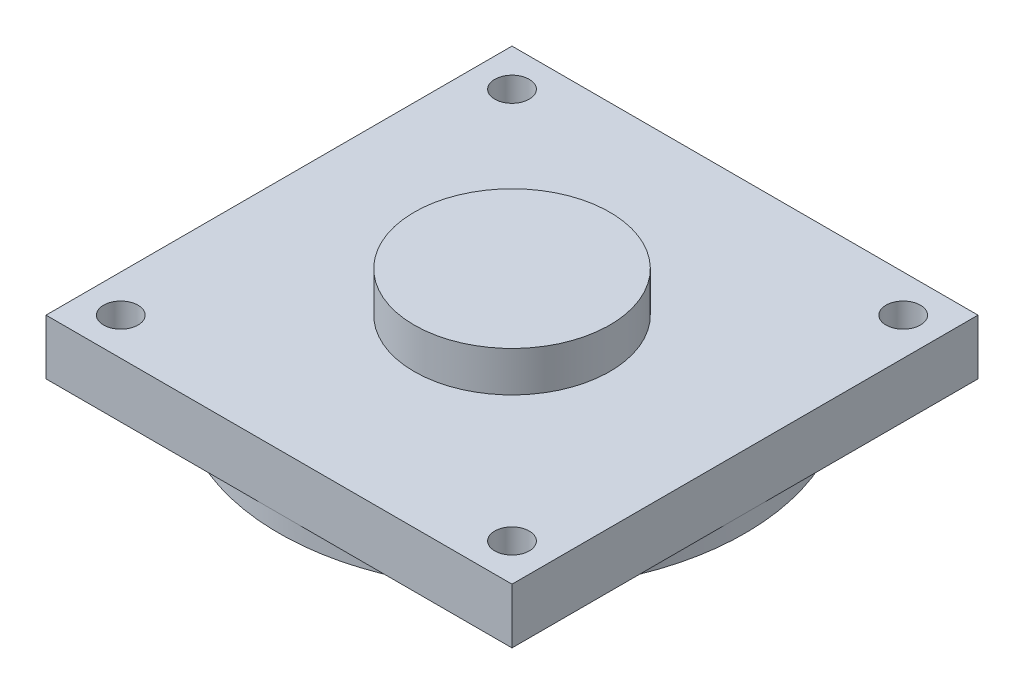
ISO-10303-21;
HEADER;
FILE_DESCRIPTION(('STEP AP214'),'2;1');
FILE_NAME('part.step','',(''),(''),'','','');
FILE_SCHEMA(('AUTOMOTIVE_DESIGN { 1 0 10303 214 1 1 1 1 }'));
ENDSEC;
DATA;
#1=APPLICATION_CONTEXT('core data for automotive mechanical design processes');
#2=APPLICATION_PROTOCOL_DEFINITION('international standard','automotive_design',2000,#1);
#3=PRODUCT_CONTEXT('',#1,'mechanical');
#4=PRODUCT('Part','Part','',(#3));
#5=PRODUCT_RELATED_PRODUCT_CATEGORY('part','',(#4));
#6=PRODUCT_DEFINITION_FORMATION('','',#4);
#7=PRODUCT_DEFINITION_CONTEXT('part definition',#1,'design');
#8=PRODUCT_DEFINITION('design','',#6,#7);
#9=PRODUCT_DEFINITION_SHAPE('','',#8);
#10=(LENGTH_UNIT() NAMED_UNIT(*) SI_UNIT(.MILLI.,.METRE.));
#11=(NAMED_UNIT(*) PLANE_ANGLE_UNIT() SI_UNIT($,.RADIAN.));
#12=(NAMED_UNIT(*) SI_UNIT($,.STERADIAN.) SOLID_ANGLE_UNIT());
#13=UNCERTAINTY_MEASURE_WITH_UNIT(LENGTH_MEASURE(1.E-05),#10,'distance_accuracy_value','');
#14=(GEOMETRIC_REPRESENTATION_CONTEXT(3) GLOBAL_UNCERTAINTY_ASSIGNED_CONTEXT((#13)) GLOBAL_UNIT_ASSIGNED_CONTEXT((#10,
#11,#12)) REPRESENTATION_CONTEXT('',''));
#15=CARTESIAN_POINT('',(0.,0.,0.));
#16=DIRECTION('',(0.,0.,1.));
#17=DIRECTION('',(1.,0.,0.));
#18=AXIS2_PLACEMENT_3D('',#15,#16,#17);
#19=CARTESIAN_POINT('',(0.,0.,0.));
#20=DIRECTION('',(0.,1.,0.));
#21=DIRECTION('',(0.,0.,1.));
#22=AXIS2_PLACEMENT_3D('',#19,#20,#21);
#23=PLANE('',#22);
#24=CARTESIAN_POINT('',(0.,0.,0.));
#25=DIRECTION('',(0.,-1.,0.));
#26=DIRECTION('',(0.,0.,-1.));
#27=AXIS2_PLACEMENT_3D('',#24,#25,#26);
#28=CIRCLE('',#27,20.25);
#29=CARTESIAN_POINT('',(0.,0.,-20.25));
#30=VERTEX_POINT('',#29);
#31=CARTESIAN_POINT('',(20.25,0.,0.));
#32=VERTEX_POINT('',#31);
#33=EDGE_CURVE('E46',#30,#32,#28,.T.);
#34=ORIENTED_EDGE('',*,*,#33,.F.);
#35=DIRECTION('',(-1.,0.,0.));
#36=VECTOR('',#35,1.);
#37=CARTESIAN_POINT('',(-20.25,0.,-20.25));
#38=LINE('',#37,#36);
#39=CARTESIAN_POINT('',(20.25,0.,-20.25));
#40=VERTEX_POINT('',#39);
#41=EDGE_CURVE('E93',#40,#30,#38,.T.);
#42=ORIENTED_EDGE('',*,*,#41,.F.);
#43=DIRECTION('',(0.,0.,-1.));
#44=VECTOR('',#43,1.);
#45=CARTESIAN_POINT('',(20.25,0.,-20.25));
#46=LINE('',#45,#44);
#47=EDGE_CURVE('E111',#32,#40,#46,.T.);
#48=ORIENTED_EDGE('',*,*,#47,.F.);
#49=EDGE_LOOP('',(#34,#42,#48));
#50=FACE_BOUND('',#49,.T.);
#51=CARTESIAN_POINT('',(17.,0.,-17.));
#52=DIRECTION('',(0.,1.,0.));
#53=DIRECTION('',(0.,0.,1.));
#54=AXIS2_PLACEMENT_3D('',#51,#52,#53);
#55=CIRCLE('',#54,1.5);
#56=CARTESIAN_POINT('',(17.,0.,-15.5));
#57=VERTEX_POINT('',#56);
#58=EDGE_CURVE('E140',#57,#57,#55,.T.);
#59=ORIENTED_EDGE('',*,*,#58,.T.);
#60=EDGE_LOOP('',(#59));
#61=FACE_BOUND('',#60,.T.);
#62=ADVANCED_FACE('F35',(#50,#61),#23,.F.);
#63=CARTESIAN_POINT('',(0.,0.,20.25));
#64=VERTEX_POINT('',#63);
#65=EDGE_CURVE('E11',#32,#64,#28,.T.);
#66=ORIENTED_EDGE('',*,*,#65,.F.);
#67=CARTESIAN_POINT('',(20.25,0.,20.25));
#68=VERTEX_POINT('',#67);
#69=EDGE_CURVE('E108',#68,#32,#46,.T.);
#70=ORIENTED_EDGE('',*,*,#69,.F.);
#71=DIRECTION('',(1.,0.,0.));
#72=VECTOR('',#71,1.);
#73=CARTESIAN_POINT('',(-20.25,0.,20.25));
#74=LINE('',#73,#72);
#75=EDGE_CURVE('E161',#64,#68,#74,.T.);
#76=ORIENTED_EDGE('',*,*,#75,.F.);
#77=EDGE_LOOP('',(#66,#70,#76));
#78=FACE_BOUND('',#77,.T.);
#79=CARTESIAN_POINT('',(17.,0.,17.));
#80=DIRECTION('',(0.,1.,0.));
#81=DIRECTION('',(0.,0.,1.));
#82=AXIS2_PLACEMENT_3D('',#79,#80,#81);
#83=CIRCLE('',#82,1.5);
#84=CARTESIAN_POINT('',(17.,0.,18.5));
#85=VERTEX_POINT('',#84);
#86=EDGE_CURVE('E134',#85,#85,#83,.T.);
#87=ORIENTED_EDGE('',*,*,#86,.T.);
#88=EDGE_LOOP('',(#87));
#89=FACE_BOUND('',#88,.T.);
#90=ADVANCED_FACE('F181',(#78,#89),#23,.F.);
#91=CARTESIAN_POINT('',(-20.25,0.,0.));
#92=VERTEX_POINT('',#91);
#93=EDGE_CURVE('E44',#64,#92,#28,.T.);
#94=ORIENTED_EDGE('',*,*,#93,.F.);
#95=CARTESIAN_POINT('',(-20.25,0.,20.25));
#96=VERTEX_POINT('',#95);
#97=EDGE_CURVE('E152',#96,#64,#74,.T.);
#98=ORIENTED_EDGE('',*,*,#97,.F.);
#99=DIRECTION('',(0.,0.,1.));
#100=VECTOR('',#99,1.);
#101=CARTESIAN_POINT('',(-20.25,0.,-20.25));
#102=LINE('',#101,#100);
#103=EDGE_CURVE('E102',#92,#96,#102,.T.);
#104=ORIENTED_EDGE('',*,*,#103,.F.);
#105=EDGE_LOOP('',(#94,#98,#104));
#106=FACE_BOUND('',#105,.T.);
#107=CARTESIAN_POINT('',(-17.,0.,17.));
#108=DIRECTION('',(0.,1.,0.));
#109=DIRECTION('',(0.,0.,1.));
#110=AXIS2_PLACEMENT_3D('',#107,#108,#109);
#111=CIRCLE('',#110,1.5);
#112=CARTESIAN_POINT('',(-17.,0.,18.5));
#113=VERTEX_POINT('',#112);
#114=EDGE_CURVE('E128',#113,#113,#111,.T.);
#115=ORIENTED_EDGE('',*,*,#114,.T.);
#116=EDGE_LOOP('',(#115));
#117=FACE_BOUND('',#116,.T.);
#118=ADVANCED_FACE('F185',(#106,#117),#23,.F.);
#119=CARTESIAN_POINT('',(20.25,4.8,-20.25));
#120=DIRECTION('',(-1.,0.,0.));
#121=DIRECTION('',(0.,0.,1.));
#122=AXIS2_PLACEMENT_3D('',#119,#120,#121);
#123=PLANE('',#122);
#124=ORIENTED_EDGE('',*,*,#69,.T.);
#125=ORIENTED_EDGE('',*,*,#47,.T.);
#126=DIRECTION('',(0.,-1.,0.));
#127=VECTOR('',#126,1.);
#128=CARTESIAN_POINT('',(20.25,4.8,-20.25));
#129=LINE('',#128,#127);
#130=CARTESIAN_POINT('',(20.25,4.8,-20.25));
#131=VERTEX_POINT('',#130);
#132=EDGE_CURVE('E39',#131,#40,#129,.T.);
#133=ORIENTED_EDGE('',*,*,#132,.F.);
#134=DIRECTION('',(0.,0.,-1.));
#135=VECTOR('',#134,1.);
#136=CARTESIAN_POINT('',(20.25,4.8,-20.25));
#137=LINE('',#136,#135);
#138=CARTESIAN_POINT('',(20.25,4.8,20.25));
#139=VERTEX_POINT('',#138);
#140=EDGE_CURVE('E148',#139,#131,#137,.T.);
#141=ORIENTED_EDGE('',*,*,#140,.F.);
#142=DIRECTION('',(0.,-1.,0.));
#143=VECTOR('',#142,1.);
#144=CARTESIAN_POINT('',(20.25,4.8,20.25));
#145=LINE('',#144,#143);
#146=EDGE_CURVE('E158',#139,#68,#145,.T.);
#147=ORIENTED_EDGE('',*,*,#146,.T.);
#148=EDGE_LOOP('',(#124,#125,#133,#141,#147));
#149=FACE_BOUND('',#148,.T.);
#150=ADVANCED_FACE('F37',(#149),#123,.F.);
#151=CARTESIAN_POINT('',(-20.25,4.8,-20.25));
#152=DIRECTION('',(0.,0.,1.));
#153=DIRECTION('',(1.,0.,0.));
#154=AXIS2_PLACEMENT_3D('',#151,#152,#153);
#155=PLANE('',#154);
#156=ORIENTED_EDGE('',*,*,#41,.T.);
#157=CARTESIAN_POINT('',(-20.25,0.,-20.25));
#158=VERTEX_POINT('',#157);
#159=EDGE_CURVE('E96',#30,#158,#38,.T.);
#160=ORIENTED_EDGE('',*,*,#159,.T.);
#161=DIRECTION('',(0.,-1.,0.));
#162=VECTOR('',#161,1.);
#163=CARTESIAN_POINT('',(-20.25,4.8,-20.25));
#164=LINE('',#163,#162);
#165=CARTESIAN_POINT('',(-20.25,4.8,-20.25));
#166=VERTEX_POINT('',#165);
#167=EDGE_CURVE('E168',#166,#158,#164,.T.);
#168=ORIENTED_EDGE('',*,*,#167,.F.);
#169=DIRECTION('',(-1.,0.,0.));
#170=VECTOR('',#169,1.);
#171=CARTESIAN_POINT('',(-20.25,4.8,-20.25));
#172=LINE('',#171,#170);
#173=EDGE_CURVE('E151',#131,#166,#172,.T.);
#174=ORIENTED_EDGE('',*,*,#173,.F.);
#175=ORIENTED_EDGE('',*,*,#132,.T.);
#176=EDGE_LOOP('',(#156,#160,#168,#174,#175));
#177=FACE_BOUND('',#176,.T.);
#178=ADVANCED_FACE('F94',(#177),#155,.F.);
#179=CARTESIAN_POINT('',(-20.25,4.8,-20.25));
#180=DIRECTION('',(1.,0.,0.));
#181=DIRECTION('',(0.,0.,-1.));
#182=AXIS2_PLACEMENT_3D('',#179,#180,#181);
#183=PLANE('',#182);
#184=EDGE_CURVE('E107',#158,#92,#102,.T.);
#185=ORIENTED_EDGE('',*,*,#184,.T.);
#186=ORIENTED_EDGE('',*,*,#103,.T.);
#187=DIRECTION('',(0.,-1.,0.));
#188=VECTOR('',#187,1.);
#189=CARTESIAN_POINT('',(-20.25,4.8,20.25));
#190=LINE('',#189,#188);
#191=CARTESIAN_POINT('',(-20.25,4.8,20.25));
#192=VERTEX_POINT('',#191);
#193=EDGE_CURVE('E166',#192,#96,#190,.T.);
#194=ORIENTED_EDGE('',*,*,#193,.F.);
#195=DIRECTION('',(0.,0.,1.));
#196=VECTOR('',#195,1.);
#197=CARTESIAN_POINT('',(-20.25,4.8,-20.25));
#198=LINE('',#197,#196);
#199=EDGE_CURVE('E154',#166,#192,#198,.T.);
#200=ORIENTED_EDGE('',*,*,#199,.F.);
#201=ORIENTED_EDGE('',*,*,#167,.T.);
#202=EDGE_LOOP('',(#185,#186,#194,#200,#201));
#203=FACE_BOUND('',#202,.T.);
#204=ADVANCED_FACE('F171',(#203),#183,.F.);
#205=CARTESIAN_POINT('',(-20.25,4.8,20.25));
#206=DIRECTION('',(0.,0.,-1.));
#207=DIRECTION('',(-1.,0.,0.));
#208=AXIS2_PLACEMENT_3D('',#205,#206,#207);
#209=PLANE('',#208);
#210=ORIENTED_EDGE('',*,*,#97,.T.);
#211=ORIENTED_EDGE('',*,*,#75,.T.);
#212=ORIENTED_EDGE('',*,*,#146,.F.);
#213=DIRECTION('',(1.,0.,0.));
#214=VECTOR('',#213,1.);
#215=CARTESIAN_POINT('',(-20.25,4.8,20.25));
#216=LINE('',#215,#214);
#217=EDGE_CURVE('E156',#192,#139,#216,.T.);
#218=ORIENTED_EDGE('',*,*,#217,.F.);
#219=ORIENTED_EDGE('',*,*,#193,.T.);
#220=EDGE_LOOP('',(#210,#211,#212,#218,#219));
#221=FACE_BOUND('',#220,.T.);
#222=ADVANCED_FACE('F184',(#221),#209,.F.);
#223=CARTESIAN_POINT('',(0.,4.8,0.));
#224=DIRECTION('',(0.,1.,0.));
#225=DIRECTION('',(0.,0.,1.));
#226=AXIS2_PLACEMENT_3D('',#223,#224,#225);
#227=PLANE('',#226);
#228=CARTESIAN_POINT('',(17.,4.8,17.));
#229=DIRECTION('',(0.,1.,0.));
#230=DIRECTION('',(0.,0.,1.));
#231=AXIS2_PLACEMENT_3D('',#228,#229,#230);
#232=CIRCLE('',#231,1.5);
#233=CARTESIAN_POINT('',(17.,4.8,18.5));
#234=VERTEX_POINT('',#233);
#235=EDGE_CURVE('E137',#234,#234,#232,.T.);
#236=ORIENTED_EDGE('',*,*,#235,.F.);
#237=EDGE_LOOP('',(#236));
#238=FACE_BOUND('',#237,.T.);
#239=CARTESIAN_POINT('',(-17.,4.8,17.));
#240=DIRECTION('',(0.,1.,0.));
#241=DIRECTION('',(0.,0.,1.));
#242=AXIS2_PLACEMENT_3D('',#239,#240,#241);
#243=CIRCLE('',#242,1.5);
#244=CARTESIAN_POINT('',(-17.,4.8,18.5));
#245=VERTEX_POINT('',#244);
#246=EDGE_CURVE('E131',#245,#245,#243,.T.);
#247=ORIENTED_EDGE('',*,*,#246,.F.);
#248=EDGE_LOOP('',(#247));
#249=FACE_BOUND('',#248,.T.);
#250=CARTESIAN_POINT('',(-17.,4.8,-17.));
#251=DIRECTION('',(0.,1.,0.));
#252=DIRECTION('',(0.,0.,1.));
#253=AXIS2_PLACEMENT_3D('',#250,#251,#252);
#254=CIRCLE('',#253,1.5);
#255=CARTESIAN_POINT('',(-17.,4.8,-15.5));
#256=VERTEX_POINT('',#255);
#257=EDGE_CURVE('E125',#256,#256,#254,.T.);
#258=ORIENTED_EDGE('',*,*,#257,.F.);
#259=EDGE_LOOP('',(#258));
#260=FACE_BOUND('',#259,.T.);
#261=CARTESIAN_POINT('',(17.,4.8,-17.));
#262=DIRECTION('',(0.,1.,0.));
#263=DIRECTION('',(0.,0.,1.));
#264=AXIS2_PLACEMENT_3D('',#261,#262,#263);
#265=CIRCLE('',#264,1.5);
#266=CARTESIAN_POINT('',(17.,4.8,-15.5));
#267=VERTEX_POINT('',#266);
#268=EDGE_CURVE('E124',#267,#267,#265,.T.);
#269=ORIENTED_EDGE('',*,*,#268,.F.);
#270=EDGE_LOOP('',(#269));
#271=FACE_BOUND('',#270,.T.);
#272=CARTESIAN_POINT('',(0.,4.8,0.));
#273=DIRECTION('',(0.,1.,0.));
#274=DIRECTION('',(0.,0.,1.));
#275=AXIS2_PLACEMENT_3D('',#272,#273,#274);
#276=CIRCLE('',#275,8.5);
#277=CARTESIAN_POINT('',(0.,4.8,8.5));
#278=VERTEX_POINT('',#277);
#279=EDGE_CURVE('E116',#278,#278,#276,.T.);
#280=ORIENTED_EDGE('',*,*,#279,.F.);
#281=EDGE_LOOP('',(#280));
#282=FACE_BOUND('',#281,.T.);
#283=ORIENTED_EDGE('',*,*,#140,.T.);
#284=ORIENTED_EDGE('',*,*,#173,.T.);
#285=ORIENTED_EDGE('',*,*,#199,.T.);
#286=ORIENTED_EDGE('',*,*,#217,.T.);
#287=EDGE_LOOP('',(#283,#284,#285,#286));
#288=FACE_BOUND('',#287,.T.);
#289=ADVANCED_FACE('F175',(#238,#249,#260,#271,#282,#288),#227,.T.);
#290=EDGE_CURVE('E53',#92,#30,#28,.T.);
#291=ORIENTED_EDGE('',*,*,#290,.F.);
#292=ORIENTED_EDGE('',*,*,#184,.F.);
#293=ORIENTED_EDGE('',*,*,#159,.F.);
#294=EDGE_LOOP('',(#291,#292,#293));
#295=FACE_BOUND('',#294,.T.);
#296=CARTESIAN_POINT('',(-17.,0.,-17.));
#297=DIRECTION('',(0.,1.,0.));
#298=DIRECTION('',(0.,0.,1.));
#299=AXIS2_PLACEMENT_3D('',#296,#297,#298);
#300=CIRCLE('',#299,1.5);
#301=CARTESIAN_POINT('',(-17.,0.,-15.5));
#302=VERTEX_POINT('',#301);
#303=EDGE_CURVE('E121',#302,#302,#300,.T.);
#304=ORIENTED_EDGE('',*,*,#303,.T.);
#305=EDGE_LOOP('',(#304));
#306=FACE_BOUND('',#305,.T.);
#307=ADVANCED_FACE('F104',(#295,#306),#23,.F.);
#308=CARTESIAN_POINT('',(0.,8.3,0.));
#309=DIRECTION('',(0.,-1.,0.));
#310=DIRECTION('',(0.,0.,-1.));
#311=AXIS2_PLACEMENT_3D('',#308,#309,#310);
#312=CYLINDRICAL_SURFACE('',#311,8.5);
#313=CARTESIAN_POINT('',(0.,8.3,0.));
#314=DIRECTION('',(0.,1.,0.));
#315=DIRECTION('',(0.,0.,1.));
#316=AXIS2_PLACEMENT_3D('',#313,#314,#315);
#317=CIRCLE('',#316,8.5);
#318=CARTESIAN_POINT('',(0.,8.3,8.5));
#319=VERTEX_POINT('',#318);
#320=EDGE_CURVE('E143',#319,#319,#317,.T.);
#321=ORIENTED_EDGE('',*,*,#320,.F.);
#322=EDGE_LOOP('',(#321));
#323=FACE_BOUND('',#322,.T.);
#324=ORIENTED_EDGE('',*,*,#279,.T.);
#325=EDGE_LOOP('',(#324));
#326=FACE_BOUND('',#325,.T.);
#327=ADVANCED_FACE('F209',(#323,#326),#312,.T.);
#328=CARTESIAN_POINT('',(0.,8.3,0.));
#329=DIRECTION('',(0.,1.,0.));
#330=DIRECTION('',(0.,0.,1.));
#331=AXIS2_PLACEMENT_3D('',#328,#329,#330);
#332=PLANE('',#331);
#333=ORIENTED_EDGE('',*,*,#320,.T.);
#334=EDGE_LOOP('',(#333));
#335=FACE_BOUND('',#334,.T.);
#336=ADVANCED_FACE('F211',(#335),#332,.T.);
#337=CARTESIAN_POINT('',(17.,0.,-17.));
#338=DIRECTION('',(0.,1.,0.));
#339=DIRECTION('',(0.,0.,1.));
#340=AXIS2_PLACEMENT_3D('',#337,#338,#339);
#341=CYLINDRICAL_SURFACE('',#340,1.5);
#342=ORIENTED_EDGE('',*,*,#58,.F.);
#343=EDGE_LOOP('',(#342));
#344=FACE_BOUND('',#343,.T.);
#345=ORIENTED_EDGE('',*,*,#268,.T.);
#346=EDGE_LOOP('',(#345));
#347=FACE_BOUND('',#346,.T.);
#348=ADVANCED_FACE('F218',(#344,#347),#341,.F.);
#349=CARTESIAN_POINT('',(-17.,0.,-17.));
#350=DIRECTION('',(0.,1.,0.));
#351=DIRECTION('',(0.,0.,1.));
#352=AXIS2_PLACEMENT_3D('',#349,#350,#351);
#353=CYLINDRICAL_SURFACE('',#352,1.5);
#354=ORIENTED_EDGE('',*,*,#303,.F.);
#355=EDGE_LOOP('',(#354));
#356=FACE_BOUND('',#355,.T.);
#357=ORIENTED_EDGE('',*,*,#257,.T.);
#358=EDGE_LOOP('',(#357));
#359=FACE_BOUND('',#358,.T.);
#360=ADVANCED_FACE('F195',(#356,#359),#353,.F.);
#361=CARTESIAN_POINT('',(-17.,0.,17.));
#362=DIRECTION('',(0.,1.,0.));
#363=DIRECTION('',(0.,0.,1.));
#364=AXIS2_PLACEMENT_3D('',#361,#362,#363);
#365=CYLINDRICAL_SURFACE('',#364,1.5);
#366=ORIENTED_EDGE('',*,*,#114,.F.);
#367=EDGE_LOOP('',(#366));
#368=FACE_BOUND('',#367,.T.);
#369=ORIENTED_EDGE('',*,*,#246,.T.);
#370=EDGE_LOOP('',(#369));
#371=FACE_BOUND('',#370,.T.);
#372=ADVANCED_FACE('F191',(#368,#371),#365,.F.);
#373=CARTESIAN_POINT('',(17.,0.,17.));
#374=DIRECTION('',(0.,1.,0.));
#375=DIRECTION('',(0.,0.,1.));
#376=AXIS2_PLACEMENT_3D('',#373,#374,#375);
#377=CYLINDRICAL_SURFACE('',#376,1.5);
#378=ORIENTED_EDGE('',*,*,#86,.F.);
#379=EDGE_LOOP('',(#378));
#380=FACE_BOUND('',#379,.T.);
#381=ORIENTED_EDGE('',*,*,#235,.T.);
#382=EDGE_LOOP('',(#381));
#383=FACE_BOUND('',#382,.T.);
#384=ADVANCED_FACE('F194',(#380,#383),#377,.F.);
#385=CARTESIAN_POINT('',(0.,-1.5,0.));
#386=DIRECTION('',(0.,1.,0.));
#387=DIRECTION('',(0.,0.,1.));
#388=AXIS2_PLACEMENT_3D('',#385,#386,#387);
#389=CYLINDRICAL_SURFACE('',#388,20.25);
#390=CARTESIAN_POINT('',(0.,-1.5,0.));
#391=DIRECTION('',(0.,-1.,0.));
#392=DIRECTION('',(0.,0.,-1.));
#393=AXIS2_PLACEMENT_3D('',#390,#391,#392);
#394=CIRCLE('',#393,20.25);
#395=CARTESIAN_POINT('',(0.,-1.5,-20.25));
#396=VERTEX_POINT('',#395);
#397=EDGE_CURVE('E114',#396,#396,#394,.T.);
#398=ORIENTED_EDGE('',*,*,#397,.F.);
#399=EDGE_LOOP('',(#398));
#400=FACE_BOUND('',#399,.T.);
#401=ORIENTED_EDGE('',*,*,#33,.T.);
#402=ORIENTED_EDGE('',*,*,#65,.T.);
#403=ORIENTED_EDGE('',*,*,#93,.T.);
#404=ORIENTED_EDGE('',*,*,#290,.T.);
#405=EDGE_LOOP('',(#401,#402,#403,#404));
#406=FACE_BOUND('',#405,.T.);
#407=ADVANCED_FACE('F115',(#400,#406),#389,.T.);
#408=CARTESIAN_POINT('',(0.,-1.5,0.));
#409=DIRECTION('',(0.,-1.,0.));
#410=DIRECTION('',(0.,0.,-1.));
#411=AXIS2_PLACEMENT_3D('',#408,#409,#410);
#412=PLANE('',#411);
#413=ORIENTED_EDGE('',*,*,#397,.T.);
#414=EDGE_LOOP('',(#413));
#415=FACE_BOUND('',#414,.T.);
#416=ADVANCED_FACE('F297',(#415),#412,.T.);
#417=CLOSED_SHELL('',(#62,#90,#118,#150,#178,#204,#222,#289,#307,#327,#336,#348,#360,#372,#384,
#407,#416));
#418=MANIFOLD_SOLID_BREP('B2',#417);
#419=ADVANCED_BREP_SHAPE_REPRESENTATION('',(#18,#418),#14);
#420=SHAPE_DEFINITION_REPRESENTATION(#9,#419);
ENDSEC;
END-ISO-10303-21;
